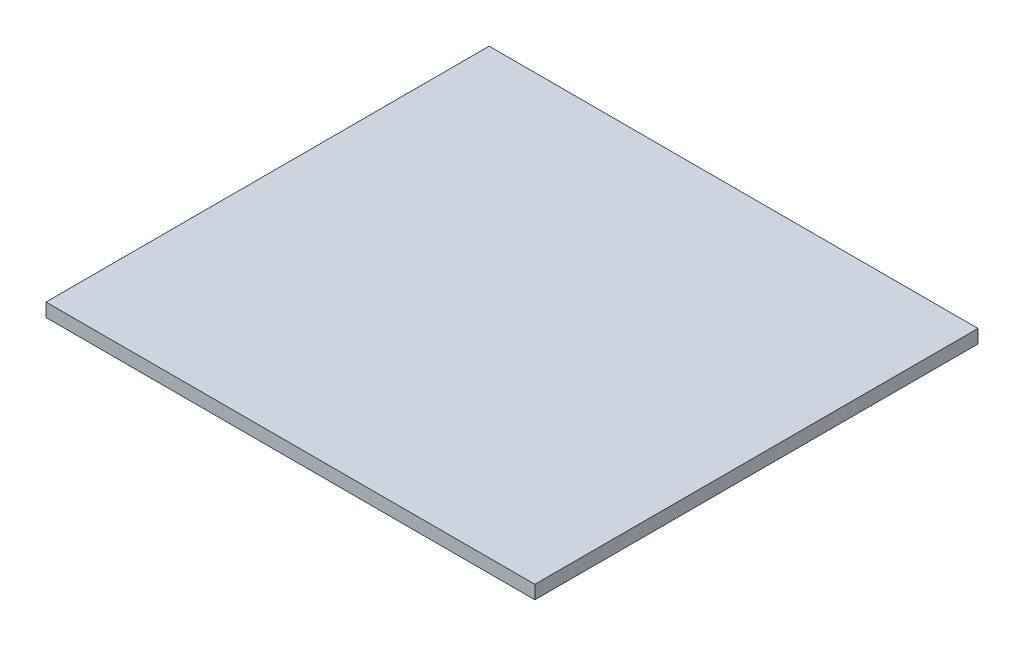
ISO-10303-21;
HEADER;
FILE_DESCRIPTION(('STEP AP214'),'2;1');
FILE_NAME('part.step','',(''),(''),'','','');
FILE_SCHEMA(('AUTOMOTIVE_DESIGN { 1 0 10303 214 1 1 1 1 }'));
ENDSEC;
DATA;
#1=APPLICATION_CONTEXT('core data for automotive mechanical design processes');
#2=APPLICATION_PROTOCOL_DEFINITION('international standard','automotive_design',2000,#1);
#3=PRODUCT_CONTEXT('',#1,'mechanical');
#4=PRODUCT('Part','Part','',(#3));
#5=PRODUCT_RELATED_PRODUCT_CATEGORY('part','',(#4));
#6=PRODUCT_DEFINITION_FORMATION('','',#4);
#7=PRODUCT_DEFINITION_CONTEXT('part definition',#1,'design');
#8=PRODUCT_DEFINITION('design','',#6,#7);
#9=PRODUCT_DEFINITION_SHAPE('','',#8);
#10=(LENGTH_UNIT() NAMED_UNIT(*) SI_UNIT(.MILLI.,.METRE.));
#11=(NAMED_UNIT(*) PLANE_ANGLE_UNIT() SI_UNIT($,.RADIAN.));
#12=(NAMED_UNIT(*) SI_UNIT($,.STERADIAN.) SOLID_ANGLE_UNIT());
#13=UNCERTAINTY_MEASURE_WITH_UNIT(LENGTH_MEASURE(1.E-05),#10,'distance_accuracy_value','');
#14=(GEOMETRIC_REPRESENTATION_CONTEXT(3) GLOBAL_UNCERTAINTY_ASSIGNED_CONTEXT((#13)) GLOBAL_UNIT_ASSIGNED_CONTEXT((#10,
#11,#12)) REPRESENTATION_CONTEXT('',''));
#15=CARTESIAN_POINT('',(0.,0.,0.));
#16=DIRECTION('',(0.,0.,1.));
#17=DIRECTION('',(1.,0.,0.));
#18=AXIS2_PLACEMENT_3D('',#15,#16,#17);
#19=CARTESIAN_POINT('',(-44.2815420560747,3.,-20.6980140186916));
#20=DIRECTION('',(1.,0.,0.));
#21=DIRECTION('',(0.,0.,-1.));
#22=AXIS2_PLACEMENT_3D('',#19,#20,#21);
#23=PLANE('',#22);
#24=DIRECTION('',(0.,0.,1.));
#25=VECTOR('',#24,1.);
#26=CARTESIAN_POINT('',(-44.2815420560747,0.,-20.6980140186916));
#27=LINE('',#26,#25);
#28=CARTESIAN_POINT('',(-44.2815420560747,0.,-20.6980140186916));
#29=VERTEX_POINT('',#28);
#30=CARTESIAN_POINT('',(-44.2815420560747,0.,78.1019859813084));
#31=VERTEX_POINT('',#30);
#32=EDGE_CURVE('E96',#29,#31,#27,.T.);
#33=ORIENTED_EDGE('',*,*,#32,.T.);
#34=DIRECTION('',(0.,-1.,0.));
#35=VECTOR('',#34,1.);
#36=CARTESIAN_POINT('',(-44.2815420560747,3.,78.1019859813084));
#37=LINE('',#36,#35);
#38=CARTESIAN_POINT('',(-44.2815420560747,3.,78.1019859813084));
#39=VERTEX_POINT('',#38);
#40=EDGE_CURVE('E11',#39,#31,#37,.T.);
#41=ORIENTED_EDGE('',*,*,#40,.F.);
#42=DIRECTION('',(0.,0.,1.));
#43=VECTOR('',#42,1.);
#44=CARTESIAN_POINT('',(-44.2815420560747,3.,-20.6980140186916));
#45=LINE('',#44,#43);
#46=CARTESIAN_POINT('',(-44.2815420560747,3.,-20.6980140186916));
#47=VERTEX_POINT('',#46);
#48=EDGE_CURVE('E84',#47,#39,#45,.T.);
#49=ORIENTED_EDGE('',*,*,#48,.F.);
#50=DIRECTION('',(0.,-1.,0.));
#51=VECTOR('',#50,1.);
#52=CARTESIAN_POINT('',(-44.2815420560747,3.,-20.6980140186916));
#53=LINE('',#52,#51);
#54=EDGE_CURVE('E92',#47,#29,#53,.T.);
#55=ORIENTED_EDGE('',*,*,#54,.T.);
#56=EDGE_LOOP('',(#33,#41,#49,#55));
#57=FACE_BOUND('',#56,.T.);
#58=ADVANCED_FACE('F33',(#57),#23,.F.);
#59=CARTESIAN_POINT('',(-44.2815420560747,3.,78.1019859813084));
#60=DIRECTION('',(0.,0.,-1.));
#61=DIRECTION('',(-1.,0.,0.));
#62=AXIS2_PLACEMENT_3D('',#59,#60,#61);
#63=PLANE('',#62);
#64=DIRECTION('',(1.,0.,0.));
#65=VECTOR('',#64,1.);
#66=CARTESIAN_POINT('',(-44.2815420560747,0.,78.1019859813084));
#67=LINE('',#66,#65);
#68=CARTESIAN_POINT('',(64.7184579439253,0.,78.1019859813084));
#69=VERTEX_POINT('',#68);
#70=EDGE_CURVE('E88',#31,#69,#67,.T.);
#71=ORIENTED_EDGE('',*,*,#70,.T.);
#72=DIRECTION('',(0.,-1.,0.));
#73=VECTOR('',#72,1.);
#74=CARTESIAN_POINT('',(64.7184579439253,3.,78.1019859813084));
#75=LINE('',#74,#73);
#76=CARTESIAN_POINT('',(64.7184579439253,3.,78.1019859813084));
#77=VERTEX_POINT('',#76);
#78=EDGE_CURVE('E41',#77,#69,#75,.T.);
#79=ORIENTED_EDGE('',*,*,#78,.F.);
#80=DIRECTION('',(1.,0.,0.));
#81=VECTOR('',#80,1.);
#82=CARTESIAN_POINT('',(-44.2815420560747,3.,78.1019859813084));
#83=LINE('',#82,#81);
#84=EDGE_CURVE('E79',#39,#77,#83,.T.);
#85=ORIENTED_EDGE('',*,*,#84,.F.);
#86=ORIENTED_EDGE('',*,*,#40,.T.);
#87=EDGE_LOOP('',(#71,#79,#85,#86));
#88=FACE_BOUND('',#87,.T.);
#89=ADVANCED_FACE('F87',(#88),#63,.F.);
#90=CARTESIAN_POINT('',(64.7184579439252,3.,-20.6980140186916));
#91=DIRECTION('',(-1.,0.,0.));
#92=DIRECTION('',(0.,0.,1.));
#93=AXIS2_PLACEMENT_3D('',#90,#91,#92);
#94=PLANE('',#93);
#95=DIRECTION('',(0.,0.,-1.));
#96=VECTOR('',#95,1.);
#97=CARTESIAN_POINT('',(64.7184579439252,0.,-20.6980140186916));
#98=LINE('',#97,#96);
#99=CARTESIAN_POINT('',(64.7184579439252,0.,-20.6980140186916));
#100=VERTEX_POINT('',#99);
#101=EDGE_CURVE('E66',#69,#100,#98,.T.);
#102=ORIENTED_EDGE('',*,*,#101,.T.);
#103=DIRECTION('',(0.,-1.,0.));
#104=VECTOR('',#103,1.);
#105=CARTESIAN_POINT('',(64.7184579439252,3.,-20.6980140186916));
#106=LINE('',#105,#104);
#107=CARTESIAN_POINT('',(64.7184579439252,3.,-20.6980140186916));
#108=VERTEX_POINT('',#107);
#109=EDGE_CURVE('E89',#108,#100,#106,.T.);
#110=ORIENTED_EDGE('',*,*,#109,.F.);
#111=DIRECTION('',(0.,0.,-1.));
#112=VECTOR('',#111,1.);
#113=CARTESIAN_POINT('',(64.7184579439252,3.,-20.6980140186916));
#114=LINE('',#113,#112);
#115=EDGE_CURVE('E82',#77,#108,#114,.T.);
#116=ORIENTED_EDGE('',*,*,#115,.F.);
#117=ORIENTED_EDGE('',*,*,#78,.T.);
#118=EDGE_LOOP('',(#102,#110,#116,#117));
#119=FACE_BOUND('',#118,.T.);
#120=ADVANCED_FACE('F90',(#119),#94,.F.);
#121=CARTESIAN_POINT('',(-44.2815420560747,3.,-20.6980140186916));
#122=DIRECTION('',(0.,0.,1.));
#123=DIRECTION('',(1.,0.,0.));
#124=AXIS2_PLACEMENT_3D('',#121,#122,#123);
#125=PLANE('',#124);
#126=DIRECTION('',(-1.,0.,0.));
#127=VECTOR('',#126,1.);
#128=CARTESIAN_POINT('',(-44.2815420560747,0.,-20.6980140186916));
#129=LINE('',#128,#127);
#130=EDGE_CURVE('E72',#100,#29,#129,.T.);
#131=ORIENTED_EDGE('',*,*,#130,.T.);
#132=ORIENTED_EDGE('',*,*,#54,.F.);
#133=DIRECTION('',(-1.,0.,0.));
#134=VECTOR('',#133,1.);
#135=CARTESIAN_POINT('',(-44.2815420560747,3.,-20.6980140186916));
#136=LINE('',#135,#134);
#137=EDGE_CURVE('E49',#108,#47,#136,.T.);
#138=ORIENTED_EDGE('',*,*,#137,.F.);
#139=ORIENTED_EDGE('',*,*,#109,.T.);
#140=EDGE_LOOP('',(#131,#132,#138,#139));
#141=FACE_BOUND('',#140,.T.);
#142=ADVANCED_FACE('F103',(#141),#125,.F.);
#143=CARTESIAN_POINT('',(0.,3.,0.));
#144=DIRECTION('',(0.,1.,0.));
#145=DIRECTION('',(0.,0.,1.));
#146=AXIS2_PLACEMENT_3D('',#143,#144,#145);
#147=PLANE('',#146);
#148=ORIENTED_EDGE('',*,*,#48,.T.);
#149=ORIENTED_EDGE('',*,*,#84,.T.);
#150=ORIENTED_EDGE('',*,*,#115,.T.);
#151=ORIENTED_EDGE('',*,*,#137,.T.);
#152=EDGE_LOOP('',(#148,#149,#150,#151));
#153=FACE_BOUND('',#152,.T.);
#154=ADVANCED_FACE('F80',(#153),#147,.T.);
#155=CARTESIAN_POINT('',(0.,0.,0.));
#156=DIRECTION('',(0.,1.,0.));
#157=DIRECTION('',(0.,0.,1.));
#158=AXIS2_PLACEMENT_3D('',#155,#156,#157);
#159=PLANE('',#158);
#160=ORIENTED_EDGE('',*,*,#32,.F.);
#161=ORIENTED_EDGE('',*,*,#130,.F.);
#162=ORIENTED_EDGE('',*,*,#101,.F.);
#163=ORIENTED_EDGE('',*,*,#70,.F.);
#164=EDGE_LOOP('',(#160,#161,#162,#163));
#165=FACE_BOUND('',#164,.T.);
#166=ADVANCED_FACE('F106',(#165),#159,.F.);
#167=CLOSED_SHELL('',(#58,#89,#120,#142,#154,#166));
#168=MANIFOLD_SOLID_BREP('B2',#167);
#169=ADVANCED_BREP_SHAPE_REPRESENTATION('',(#18,#168),#14);
#170=SHAPE_DEFINITION_REPRESENTATION(#9,#169);
ENDSEC;
END-ISO-10303-21;
